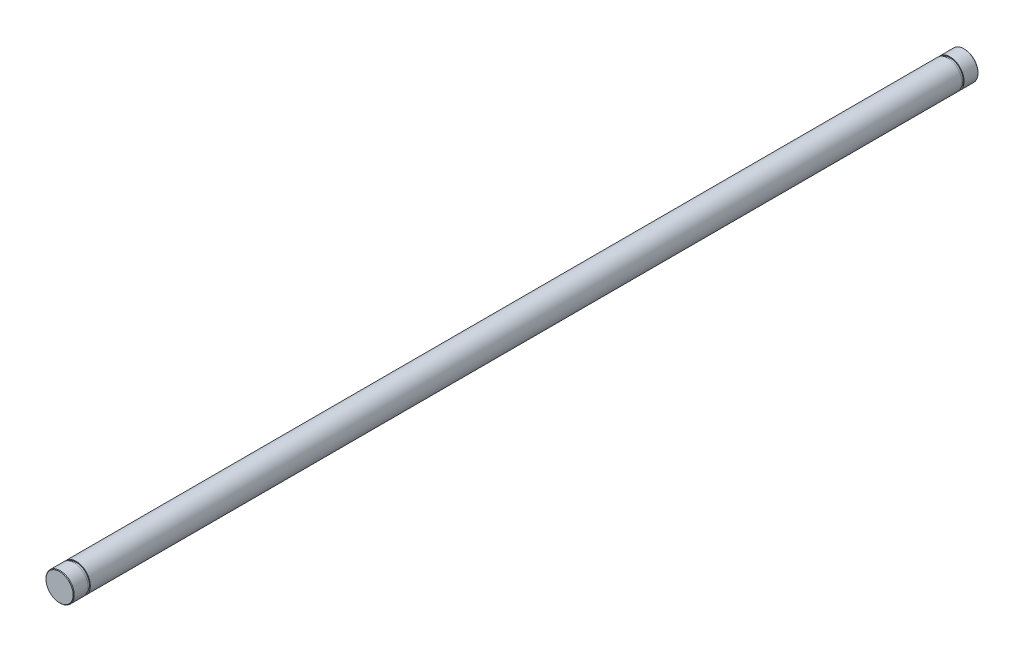
ISO-10303-21;
HEADER;
FILE_DESCRIPTION(('STEP AP214'),'2;1');
FILE_NAME('part.step','',(''),(''),'','','');
FILE_SCHEMA(('AUTOMOTIVE_DESIGN { 1 0 10303 214 1 1 1 1 }'));
ENDSEC;
DATA;
#1=APPLICATION_CONTEXT('core data for automotive mechanical design processes');
#2=APPLICATION_PROTOCOL_DEFINITION('international standard','automotive_design',2000,#1);
#3=PRODUCT_CONTEXT('',#1,'mechanical');
#4=PRODUCT('Part','Part','',(#3));
#5=PRODUCT_RELATED_PRODUCT_CATEGORY('part','',(#4));
#6=PRODUCT_DEFINITION_FORMATION('','',#4);
#7=PRODUCT_DEFINITION_CONTEXT('part definition',#1,'design');
#8=PRODUCT_DEFINITION('design','',#6,#7);
#9=PRODUCT_DEFINITION_SHAPE('','',#8);
#10=(LENGTH_UNIT() NAMED_UNIT(*) SI_UNIT(.MILLI.,.METRE.));
#11=(NAMED_UNIT(*) PLANE_ANGLE_UNIT() SI_UNIT($,.RADIAN.));
#12=(NAMED_UNIT(*) SI_UNIT($,.STERADIAN.) SOLID_ANGLE_UNIT());
#13=UNCERTAINTY_MEASURE_WITH_UNIT(LENGTH_MEASURE(1.E-05),#10,'distance_accuracy_value','');
#14=(GEOMETRIC_REPRESENTATION_CONTEXT(3) GLOBAL_UNCERTAINTY_ASSIGNED_CONTEXT((#13)) GLOBAL_UNIT_ASSIGNED_CONTEXT((#10,
#11,#12)) REPRESENTATION_CONTEXT('',''));
#15=CARTESIAN_POINT('',(0.,0.,0.));
#16=DIRECTION('',(0.,0.,1.));
#17=DIRECTION('',(1.,0.,0.));
#18=AXIS2_PLACEMENT_3D('',#15,#16,#17);
#19=CARTESIAN_POINT('',(0.,0.,152.4));
#20=DIRECTION('',(0.,0.,-1.));
#21=DIRECTION('',(-1.,0.,0.));
#22=AXIS2_PLACEMENT_3D('',#19,#20,#21);
#23=CYLINDRICAL_SURFACE('',#22,4.7625);
#24=CARTESIAN_POINT('',(-5.06087274449011E-13,0.,-147.5366));
#25=DIRECTION('',(0.,0.,1.));
#26=DIRECTION('',(1.,0.,0.));
#27=AXIS2_PLACEMENT_3D('',#24,#25,#26);
#28=CIRCLE('',#27,4.76250000000051);
#29=CARTESIAN_POINT('',(4.7625,0.,-147.5366));
#30=VERTEX_POINT('',#29);
#31=EDGE_CURVE('E68',#30,#30,#28,.T.);
#32=ORIENTED_EDGE('',*,*,#31,.F.);
#33=EDGE_LOOP('',(#32));
#34=FACE_BOUND('',#33,.T.);
#35=CARTESIAN_POINT('',(0.,0.,-152.2095));
#36=DIRECTION('',(0.,0.,1.));
#37=DIRECTION('',(1.,0.,0.));
#38=AXIS2_PLACEMENT_3D('',#35,#36,#37);
#39=CIRCLE('',#38,4.7625);
#40=CARTESIAN_POINT('',(4.7625,0.,-152.2095));
#41=VERTEX_POINT('',#40);
#42=EDGE_CURVE('E55',#41,#41,#39,.T.);
#43=ORIENTED_EDGE('',*,*,#42,.T.);
#44=EDGE_LOOP('',(#43));
#45=FACE_BOUND('',#44,.T.);
#46=ADVANCED_FACE('F44',(#34,#45),#23,.T.);
#47=CARTESIAN_POINT('',(0.,0.,-152.4));
#48=DIRECTION('',(0.,0.,1.));
#49=DIRECTION('',(1.,0.,0.));
#50=AXIS2_PLACEMENT_3D('',#47,#48,#49);
#51=PLANE('',#50);
#52=CARTESIAN_POINT('',(0.,0.,-152.4));
#53=DIRECTION('',(0.,0.,1.));
#54=DIRECTION('',(1.,0.,0.));
#55=AXIS2_PLACEMENT_3D('',#52,#53,#54);
#56=CIRCLE('',#55,4.57199999999969);
#57=CARTESIAN_POINT('',(4.57199999999969,0.,-152.4));
#58=VERTEX_POINT('',#57);
#59=EDGE_CURVE('E51',#58,#58,#56,.F.);
#60=ORIENTED_EDGE('',*,*,#59,.T.);
#61=EDGE_LOOP('',(#60));
#62=FACE_BOUND('',#61,.T.);
#63=ADVANCED_FACE('F93',(#62),#51,.F.);
#64=CARTESIAN_POINT('',(0.,0.,-152.2095));
#65=DIRECTION('',(0.,0.,1.));
#66=DIRECTION('',(1.,0.,0.));
#67=AXIS2_PLACEMENT_3D('',#64,#65,#66);
#68=CONICAL_SURFACE('',#67,4.7625,0.785398163397589);
#69=ORIENTED_EDGE('',*,*,#59,.F.);
#70=EDGE_LOOP('',(#69));
#71=FACE_BOUND('',#70,.T.);
#72=ORIENTED_EDGE('',*,*,#42,.F.);
#73=EDGE_LOOP('',(#72));
#74=FACE_BOUND('',#73,.T.);
#75=ADVANCED_FACE('F99',(#71,#74),#68,.T.);
#76=CARTESIAN_POINT('',(4.7625,0.,-146.8));
#77=DIRECTION('',(0.,0.,1.));
#78=DIRECTION('',(1.,0.,0.));
#79=AXIS2_PLACEMENT_3D('',#76,#77,#78);
#80=PLANE('',#79);
#81=CARTESIAN_POINT('',(-5.03560553036431E-13,0.,-146.8));
#82=DIRECTION('',(0.,0.,1.));
#83=DIRECTION('',(1.,0.,0.));
#84=AXIS2_PLACEMENT_3D('',#81,#82,#83);
#85=CIRCLE('',#84,4.7625000000005);
#86=CARTESIAN_POINT('',(4.7625,0.,-146.8));
#87=VERTEX_POINT('',#86);
#88=EDGE_CURVE('E64',#87,#87,#85,.T.);
#89=ORIENTED_EDGE('',*,*,#88,.F.);
#90=EDGE_LOOP('',(#89));
#91=FACE_BOUND('',#90,.T.);
#92=CARTESIAN_POINT('',(-5.03560553036431E-13,0.,-146.8));
#93=DIRECTION('',(0.,0.,1.));
#94=DIRECTION('',(1.,0.,0.));
#95=AXIS2_PLACEMENT_3D('',#92,#93,#94);
#96=CIRCLE('',#95,4.4704000000005);
#97=CARTESIAN_POINT('',(4.4704,0.,-146.8));
#98=VERTEX_POINT('',#97);
#99=EDGE_CURVE('E80',#98,#98,#96,.T.);
#100=ORIENTED_EDGE('',*,*,#99,.T.);
#101=EDGE_LOOP('',(#100));
#102=FACE_BOUND('',#101,.T.);
#103=ADVANCED_FACE('F101',(#91,#102),#80,.F.);
#104=CARTESIAN_POINT('',(3.43024899888577E-12,0.,1000.));
#105=DIRECTION('',(0.,0.,1.));
#106=DIRECTION('',(1.,0.,0.));
#107=AXIS2_PLACEMENT_3D('',#104,#105,#106);
#108=CYLINDRICAL_SURFACE('',#107,4.4704000000005);
#109=ORIENTED_EDGE('',*,*,#99,.F.);
#110=EDGE_LOOP('',(#109));
#111=FACE_BOUND('',#110,.T.);
#112=CARTESIAN_POINT('',(-5.06087274449011E-13,0.,-147.5366));
#113=DIRECTION('',(0.,0.,1.));
#114=DIRECTION('',(1.,0.,0.));
#115=AXIS2_PLACEMENT_3D('',#112,#113,#114);
#116=CIRCLE('',#115,4.47040000000051);
#117=CARTESIAN_POINT('',(4.4704,0.,-147.5366));
#118=VERTEX_POINT('',#117);
#119=EDGE_CURVE('E83',#118,#118,#116,.T.);
#120=ORIENTED_EDGE('',*,*,#119,.T.);
#121=EDGE_LOOP('',(#120));
#122=FACE_BOUND('',#121,.T.);
#123=ADVANCED_FACE('F108',(#111,#122),#108,.T.);
#124=CARTESIAN_POINT('',(4.7625,0.,-147.5366));
#125=DIRECTION('',(0.,0.,-1.));
#126=DIRECTION('',(-1.,0.,0.));
#127=AXIS2_PLACEMENT_3D('',#124,#125,#126);
#128=PLANE('',#127);
#129=ORIENTED_EDGE('',*,*,#119,.F.);
#130=EDGE_LOOP('',(#129));
#131=FACE_BOUND('',#130,.T.);
#132=ORIENTED_EDGE('',*,*,#31,.T.);
#133=EDGE_LOOP('',(#132));
#134=FACE_BOUND('',#133,.T.);
#135=ADVANCED_FACE('F89',(#131,#134),#128,.F.);
#136=ORIENTED_EDGE('',*,*,#88,.T.);
#137=EDGE_LOOP('',(#136));
#138=FACE_BOUND('',#137,.T.);
#139=CARTESIAN_POINT('',(5.0356055303643E-13,0.,146.8));
#140=DIRECTION('',(0.,0.,1.));
#141=DIRECTION('',(1.,0.,0.));
#142=AXIS2_PLACEMENT_3D('',#139,#140,#141);
#143=CIRCLE('',#142,4.7624999999995);
#144=CARTESIAN_POINT('',(4.7625,0.,146.8));
#145=VERTEX_POINT('',#144);
#146=EDGE_CURVE('E65',#145,#145,#143,.T.);
#147=ORIENTED_EDGE('',*,*,#146,.F.);
#148=EDGE_LOOP('',(#147));
#149=FACE_BOUND('',#148,.T.);
#150=ADVANCED_FACE('F96',(#138,#149),#23,.T.);
#151=CARTESIAN_POINT('',(4.7625,0.,146.8));
#152=DIRECTION('',(0.,0.,-1.));
#153=DIRECTION('',(-1.,0.,0.));
#154=AXIS2_PLACEMENT_3D('',#151,#152,#153);
#155=PLANE('',#154);
#156=CARTESIAN_POINT('',(5.0356055303643E-13,0.,146.8));
#157=DIRECTION('',(0.,0.,1.));
#158=DIRECTION('',(1.,0.,0.));
#159=AXIS2_PLACEMENT_3D('',#156,#157,#158);
#160=CIRCLE('',#159,4.4703999999995);
#161=CARTESIAN_POINT('',(4.4704,0.,146.8));
#162=VERTEX_POINT('',#161);
#163=EDGE_CURVE('E69',#162,#162,#160,.T.);
#164=ORIENTED_EDGE('',*,*,#163,.F.);
#165=EDGE_LOOP('',(#164));
#166=FACE_BOUND('',#165,.T.);
#167=ORIENTED_EDGE('',*,*,#146,.T.);
#168=EDGE_LOOP('',(#167));
#169=FACE_BOUND('',#168,.T.);
#170=ADVANCED_FACE('F119',(#166,#169),#155,.F.);
#171=CARTESIAN_POINT('',(3.43024899888577E-12,0.,1000.));
#172=DIRECTION('',(0.,0.,1.));
#173=DIRECTION('',(1.,0.,0.));
#174=AXIS2_PLACEMENT_3D('',#171,#172,#173);
#175=CYLINDRICAL_SURFACE('',#174,4.47039999999949);
#176=CARTESIAN_POINT('',(5.06087274449009E-13,0.,147.5366));
#177=DIRECTION('',(0.,0.,1.));
#178=DIRECTION('',(1.,0.,0.));
#179=AXIS2_PLACEMENT_3D('',#176,#177,#178);
#180=CIRCLE('',#179,4.47039999999949);
#181=CARTESIAN_POINT('',(4.4704,0.,147.5366));
#182=VERTEX_POINT('',#181);
#183=EDGE_CURVE('E72',#182,#182,#180,.T.);
#184=ORIENTED_EDGE('',*,*,#183,.F.);
#185=EDGE_LOOP('',(#184));
#186=FACE_BOUND('',#185,.T.);
#187=ORIENTED_EDGE('',*,*,#163,.T.);
#188=EDGE_LOOP('',(#187));
#189=FACE_BOUND('',#188,.T.);
#190=ADVANCED_FACE('F122',(#186,#189),#175,.T.);
#191=CARTESIAN_POINT('',(4.7625,0.,147.5366));
#192=DIRECTION('',(0.,0.,1.));
#193=DIRECTION('',(1.,0.,0.));
#194=AXIS2_PLACEMENT_3D('',#191,#192,#193);
#195=PLANE('',#194);
#196=CARTESIAN_POINT('',(5.06087274449009E-13,0.,147.5366));
#197=DIRECTION('',(0.,0.,1.));
#198=DIRECTION('',(1.,0.,0.));
#199=AXIS2_PLACEMENT_3D('',#196,#197,#198);
#200=CIRCLE('',#199,4.76249999999949);
#201=CARTESIAN_POINT('',(4.7625,0.,147.5366));
#202=VERTEX_POINT('',#201);
#203=EDGE_CURVE('E75',#202,#202,#200,.T.);
#204=ORIENTED_EDGE('',*,*,#203,.F.);
#205=EDGE_LOOP('',(#204));
#206=FACE_BOUND('',#205,.T.);
#207=ORIENTED_EDGE('',*,*,#183,.T.);
#208=EDGE_LOOP('',(#207));
#209=FACE_BOUND('',#208,.T.);
#210=ADVANCED_FACE('F117',(#206,#209),#195,.F.);
#211=CARTESIAN_POINT('',(0.,0.,152.4));
#212=DIRECTION('',(0.,0.,1.));
#213=DIRECTION('',(1.,0.,0.));
#214=AXIS2_PLACEMENT_3D('',#211,#212,#213);
#215=PLANE('',#214);
#216=CARTESIAN_POINT('',(0.,0.,152.4));
#217=DIRECTION('',(0.,0.,1.));
#218=DIRECTION('',(1.,0.,0.));
#219=AXIS2_PLACEMENT_3D('',#216,#217,#218);
#220=CIRCLE('',#219,4.57200000000008);
#221=CARTESIAN_POINT('',(4.57200000000008,0.,152.4));
#222=VERTEX_POINT('',#221);
#223=EDGE_CURVE('E10',#222,#222,#220,.T.);
#224=ORIENTED_EDGE('',*,*,#223,.T.);
#225=EDGE_LOOP('',(#224));
#226=FACE_BOUND('',#225,.T.);
#227=ADVANCED_FACE('F115',(#226),#215,.T.);
#228=CARTESIAN_POINT('',(0.,0.,152.4));
#229=DIRECTION('',(0.,0.,-1.));
#230=DIRECTION('',(-1.,0.,0.));
#231=AXIS2_PLACEMENT_3D('',#228,#229,#230);
#232=CONICAL_SURFACE('',#231,4.57200000000008,0.785398163397444);
#233=CARTESIAN_POINT('',(0.,0.,152.2095));
#234=DIRECTION('',(0.,0.,1.));
#235=DIRECTION('',(1.,0.,0.));
#236=AXIS2_PLACEMENT_3D('',#233,#234,#235);
#237=CIRCLE('',#236,4.7625);
#238=CARTESIAN_POINT('',(4.7625,0.,152.2095));
#239=VERTEX_POINT('',#238);
#240=EDGE_CURVE('E59',#239,#239,#237,.F.);
#241=ORIENTED_EDGE('',*,*,#240,.F.);
#242=EDGE_LOOP('',(#241));
#243=FACE_BOUND('',#242,.T.);
#244=ORIENTED_EDGE('',*,*,#223,.F.);
#245=EDGE_LOOP('',(#244));
#246=FACE_BOUND('',#245,.T.);
#247=ADVANCED_FACE('F46',(#243,#246),#232,.T.);
#248=ORIENTED_EDGE('',*,*,#203,.T.);
#249=EDGE_LOOP('',(#248));
#250=FACE_BOUND('',#249,.T.);
#251=ORIENTED_EDGE('',*,*,#240,.T.);
#252=EDGE_LOOP('',(#251));
#253=FACE_BOUND('',#252,.T.);
#254=ADVANCED_FACE('F95',(#250,#253),#23,.T.);
#255=CLOSED_SHELL('',(#46,#63,#75,#103,#123,#135,#150,#170,#190,#210,#227,#247,#254));
#256=MANIFOLD_SOLID_BREP('B2',#255);
#257=ADVANCED_BREP_SHAPE_REPRESENTATION('',(#18,#256),#14);
#258=SHAPE_DEFINITION_REPRESENTATION(#9,#257);
ENDSEC;
END-ISO-10303-21;
